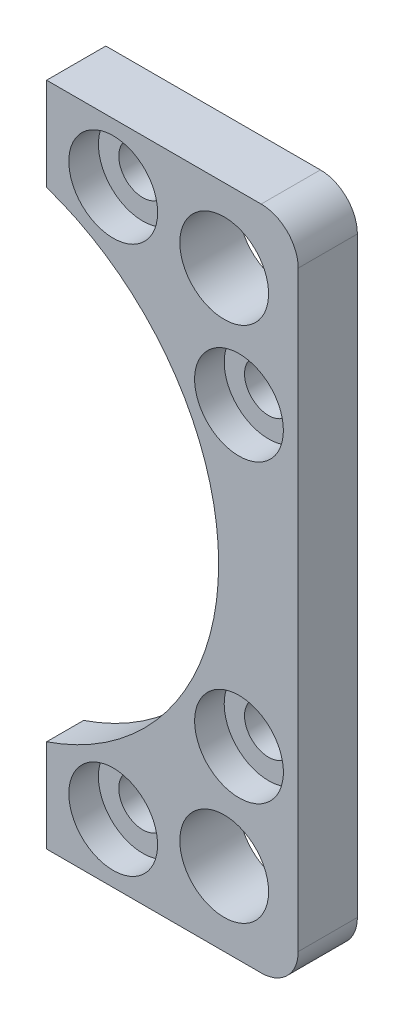
ISO-10303-21;
HEADER;
FILE_DESCRIPTION(('STEP AP214'),'2;1');
FILE_NAME('part.step','',(''),(''),'','','');
FILE_SCHEMA(('AUTOMOTIVE_DESIGN { 1 0 10303 214 1 1 1 1 }'));
ENDSEC;
DATA;
#1=APPLICATION_CONTEXT('core data for automotive mechanical design processes');
#2=APPLICATION_PROTOCOL_DEFINITION('international standard','automotive_design',2000,#1);
#3=PRODUCT_CONTEXT('',#1,'mechanical');
#4=PRODUCT('Part','Part','',(#3));
#5=PRODUCT_RELATED_PRODUCT_CATEGORY('part','',(#4));
#6=PRODUCT_DEFINITION_FORMATION('','',#4);
#7=PRODUCT_DEFINITION_CONTEXT('part definition',#1,'design');
#8=PRODUCT_DEFINITION('design','',#6,#7);
#9=PRODUCT_DEFINITION_SHAPE('','',#8);
#10=(LENGTH_UNIT() NAMED_UNIT(*) SI_UNIT(.MILLI.,.METRE.));
#11=(NAMED_UNIT(*) PLANE_ANGLE_UNIT() SI_UNIT($,.RADIAN.));
#12=(NAMED_UNIT(*) SI_UNIT($,.STERADIAN.) SOLID_ANGLE_UNIT());
#13=UNCERTAINTY_MEASURE_WITH_UNIT(LENGTH_MEASURE(1.E-05),#10,'distance_accuracy_value','');
#14=(GEOMETRIC_REPRESENTATION_CONTEXT(3) GLOBAL_UNCERTAINTY_ASSIGNED_CONTEXT((#13)) GLOBAL_UNIT_ASSIGNED_CONTEXT((#10,
#11,#12)) REPRESENTATION_CONTEXT('',''));
#15=CARTESIAN_POINT('',(0.,0.,0.));
#16=DIRECTION('',(0.,0.,1.));
#17=DIRECTION('',(1.,0.,0.));
#18=AXIS2_PLACEMENT_3D('',#15,#16,#17);
#19=CARTESIAN_POINT('',(19.9999999999998,36.9999999999999,4.));
#20=DIRECTION('',(0.,0.,-1.));
#21=DIRECTION('',(-1.,0.,0.));
#22=AXIS2_PLACEMENT_3D('',#19,#20,#21);
#23=CYLINDRICAL_SURFACE('',#22,3.25000000000001);
#24=CARTESIAN_POINT('',(19.9999999999998,36.9999999999999,-4.));
#25=DIRECTION('',(0.,0.,1.));
#26=DIRECTION('',(-1.,0.,0.));
#27=AXIS2_PLACEMENT_3D('',#24,#25,#26);
#28=CIRCLE('',#27,3.25000000000001);
#29=CARTESIAN_POINT('',(16.7499999999998,36.9999999999999,-4.));
#30=VERTEX_POINT('',#29);
#31=EDGE_CURVE('E163',#30,#30,#28,.T.);
#32=ORIENTED_EDGE('',*,*,#31,.F.);
#33=EDGE_LOOP('',(#32));
#34=FACE_BOUND('',#33,.T.);
#35=CARTESIAN_POINT('',(19.9999999999998,36.9999999999999,0.));
#36=DIRECTION('',(0.,0.,1.));
#37=DIRECTION('',(1.,0.,0.));
#38=AXIS2_PLACEMENT_3D('',#35,#36,#37);
#39=CIRCLE('',#38,3.25000000000001);
#40=CARTESIAN_POINT('',(23.2499999999998,36.9999999999999,0.));
#41=VERTEX_POINT('',#40);
#42=EDGE_CURVE('E52',#41,#41,#39,.T.);
#43=ORIENTED_EDGE('',*,*,#42,.T.);
#44=EDGE_LOOP('',(#43));
#45=FACE_BOUND('',#44,.T.);
#46=ADVANCED_FACE('F48',(#34,#45),#23,.F.);
#47=CARTESIAN_POINT('',(36.9999999999999,20.0000000000005,4.));
#48=DIRECTION('',(0.,0.,-1.));
#49=DIRECTION('',(-1.,0.,0.));
#50=AXIS2_PLACEMENT_3D('',#47,#48,#49);
#51=CYLINDRICAL_SURFACE('',#50,3.25000000000001);
#52=CARTESIAN_POINT('',(36.9999999999999,20.0000000000005,-4.));
#53=DIRECTION('',(0.,0.,1.));
#54=DIRECTION('',(-1.,0.,0.));
#55=AXIS2_PLACEMENT_3D('',#52,#53,#54);
#56=CIRCLE('',#55,3.25000000000001);
#57=CARTESIAN_POINT('',(33.7499999999999,20.0000000000005,-4.));
#58=VERTEX_POINT('',#57);
#59=EDGE_CURVE('E259',#58,#58,#56,.T.);
#60=ORIENTED_EDGE('',*,*,#59,.F.);
#61=EDGE_LOOP('',(#60));
#62=FACE_BOUND('',#61,.T.);
#63=CARTESIAN_POINT('',(36.9999999999999,20.0000000000005,0.));
#64=DIRECTION('',(0.,0.,1.));
#65=DIRECTION('',(1.,0.,0.));
#66=AXIS2_PLACEMENT_3D('',#63,#64,#65);
#67=CIRCLE('',#66,3.25000000000001);
#68=CARTESIAN_POINT('',(40.2499999999999,20.0000000000005,0.));
#69=VERTEX_POINT('',#68);
#70=EDGE_CURVE('E205',#69,#69,#67,.T.);
#71=ORIENTED_EDGE('',*,*,#70,.T.);
#72=EDGE_LOOP('',(#71));
#73=FACE_BOUND('',#72,.T.);
#74=ADVANCED_FACE('F307',(#62,#73),#51,.F.);
#75=CARTESIAN_POINT('',(0.,0.,4.));
#76=DIRECTION('',(0.,0.,-1.));
#77=DIRECTION('',(-1.,0.,0.));
#78=AXIS2_PLACEMENT_3D('',#75,#76,#77);
#79=CYLINDRICAL_SURFACE('',#78,34.25);
#80=CARTESIAN_POINT('',(0.,0.,-1.));
#81=DIRECTION('',(0.,0.,-1.));
#82=DIRECTION('',(-1.,0.,0.));
#83=AXIS2_PLACEMENT_3D('',#80,#81,#82);
#84=CIRCLE('',#83,34.25);
#85=CARTESIAN_POINT('',(11.,-32.4355129449189,-1.));
#86=VERTEX_POINT('',#85);
#87=CARTESIAN_POINT('',(11.,32.4355129449189,-1.));
#88=VERTEX_POINT('',#87);
#89=EDGE_CURVE('E244',#86,#88,#84,.F.);
#90=ORIENTED_EDGE('',*,*,#89,.F.);
#91=DIRECTION('',(0.,0.,-1.));
#92=VECTOR('',#91,1.);
#93=CARTESIAN_POINT('',(11.,-32.4355129449189,4.));
#94=LINE('',#93,#92);
#95=CARTESIAN_POINT('',(11.,-32.4355129449189,4.));
#96=VERTEX_POINT('',#95);
#97=EDGE_CURVE('E175',#96,#86,#94,.T.);
#98=ORIENTED_EDGE('',*,*,#97,.F.);
#99=CARTESIAN_POINT('',(0.,0.,4.));
#100=DIRECTION('',(0.,0.,-1.));
#101=DIRECTION('',(-1.,0.,0.));
#102=AXIS2_PLACEMENT_3D('',#99,#100,#101);
#103=CIRCLE('',#102,34.25);
#104=CARTESIAN_POINT('',(11.,32.4355129449189,4.));
#105=VERTEX_POINT('',#104);
#106=EDGE_CURVE('E273',#105,#96,#103,.T.);
#107=ORIENTED_EDGE('',*,*,#106,.F.);
#108=DIRECTION('',(0.,0.,-1.));
#109=VECTOR('',#108,1.);
#110=CARTESIAN_POINT('',(11.,32.4355129449189,4.));
#111=LINE('',#110,#109);
#112=EDGE_CURVE('E179',#105,#88,#111,.T.);
#113=ORIENTED_EDGE('',*,*,#112,.T.);
#114=EDGE_LOOP('',(#90,#98,#107,#113));
#115=FACE_BOUND('',#114,.T.);
#116=ADVANCED_FACE('F303',(#115),#79,.F.);
#117=CARTESIAN_POINT('',(0.,0.,4.));
#118=DIRECTION('',(0.,0.,-1.));
#119=DIRECTION('',(-1.,0.,0.));
#120=AXIS2_PLACEMENT_3D('',#117,#118,#119);
#121=PLANE('',#120);
#122=CARTESIAN_POINT('',(19.9999999999998,36.9999999999999,4.));
#123=DIRECTION('',(0.,0.,1.));
#124=DIRECTION('',(1.,0.,0.));
#125=AXIS2_PLACEMENT_3D('',#122,#123,#124);
#126=CIRCLE('',#125,6.);
#127=CARTESIAN_POINT('',(25.9999999999998,36.9999999999999,4.));
#128=VERTEX_POINT('',#127);
#129=EDGE_CURVE('E221',#128,#128,#126,.T.);
#130=ORIENTED_EDGE('',*,*,#129,.F.);
#131=EDGE_LOOP('',(#130));
#132=FACE_BOUND('',#131,.T.);
#133=CARTESIAN_POINT('',(36.9999999999999,-20.0000000000005,4.));
#134=DIRECTION('',(0.,0.,1.));
#135=DIRECTION('',(-1.,0.,0.));
#136=AXIS2_PLACEMENT_3D('',#133,#134,#135);
#137=CIRCLE('',#136,6.);
#138=CARTESIAN_POINT('',(30.9999999999999,-20.0000000000005,4.));
#139=VERTEX_POINT('',#138);
#140=EDGE_CURVE('E231',#139,#139,#137,.T.);
#141=ORIENTED_EDGE('',*,*,#140,.F.);
#142=EDGE_LOOP('',(#141));
#143=FACE_BOUND('',#142,.T.);
#144=CARTESIAN_POINT('',(19.9999999999998,-36.9999999999999,4.));
#145=DIRECTION('',(0.,0.,1.));
#146=DIRECTION('',(-1.,0.,0.));
#147=AXIS2_PLACEMENT_3D('',#144,#145,#146);
#148=CIRCLE('',#147,6.);
#149=CARTESIAN_POINT('',(13.9999999999998,-36.9999999999999,4.));
#150=VERTEX_POINT('',#149);
#151=EDGE_CURVE('E230',#150,#150,#148,.T.);
#152=ORIENTED_EDGE('',*,*,#151,.F.);
#153=EDGE_LOOP('',(#152));
#154=FACE_BOUND('',#153,.T.);
#155=CARTESIAN_POINT('',(36.9999999999999,20.0000000000005,4.));
#156=DIRECTION('',(0.,0.,1.));
#157=DIRECTION('',(1.,0.,0.));
#158=AXIS2_PLACEMENT_3D('',#155,#156,#157);
#159=CIRCLE('',#158,6.);
#160=CARTESIAN_POINT('',(42.9999999999999,20.0000000000005,4.));
#161=VERTEX_POINT('',#160);
#162=EDGE_CURVE('E236',#161,#161,#159,.T.);
#163=ORIENTED_EDGE('',*,*,#162,.F.);
#164=EDGE_LOOP('',(#163));
#165=FACE_BOUND('',#164,.T.);
#166=DIRECTION('',(1.,0.,0.));
#167=VECTOR('',#166,1.);
#168=CARTESIAN_POINT('',(45.,-45.,4.));
#169=LINE('',#168,#167);
#170=CARTESIAN_POINT('',(11.0000000000003,-45.,4.));
#171=VERTEX_POINT('',#170);
#172=CARTESIAN_POINT('',(40.,-45.,4.));
#173=VERTEX_POINT('',#172);
#174=EDGE_CURVE('E277',#171,#173,#169,.T.);
#175=ORIENTED_EDGE('',*,*,#174,.T.);
#176=CARTESIAN_POINT('',(40.,-40.,4.));
#177=DIRECTION('',(0.,0.,-1.));
#178=DIRECTION('',(-1.,0.,0.));
#179=AXIS2_PLACEMENT_3D('',#176,#177,#178);
#180=CIRCLE('',#179,5.);
#181=CARTESIAN_POINT('',(45.,-40.,4.));
#182=VERTEX_POINT('',#181);
#183=EDGE_CURVE('E57',#173,#182,#180,.F.);
#184=ORIENTED_EDGE('',*,*,#183,.T.);
#185=DIRECTION('',(0.,1.,0.));
#186=VECTOR('',#185,1.);
#187=CARTESIAN_POINT('',(45.,45.,4.));
#188=LINE('',#187,#186);
#189=CARTESIAN_POINT('',(45.,40.,4.));
#190=VERTEX_POINT('',#189);
#191=EDGE_CURVE('E176',#182,#190,#188,.T.);
#192=ORIENTED_EDGE('',*,*,#191,.T.);
#193=CARTESIAN_POINT('',(40.,40.,4.));
#194=DIRECTION('',(0.,0.,-1.));
#195=DIRECTION('',(-1.,0.,0.));
#196=AXIS2_PLACEMENT_3D('',#193,#194,#195);
#197=CIRCLE('',#196,5.);
#198=CARTESIAN_POINT('',(40.,45.,4.));
#199=VERTEX_POINT('',#198);
#200=EDGE_CURVE('E65',#190,#199,#197,.F.);
#201=ORIENTED_EDGE('',*,*,#200,.T.);
#202=DIRECTION('',(-1.,0.,0.));
#203=VECTOR('',#202,1.);
#204=CARTESIAN_POINT('',(10.9999999999997,45.,4.));
#205=LINE('',#204,#203);
#206=CARTESIAN_POINT('',(10.9999999999997,45.,4.));
#207=VERTEX_POINT('',#206);
#208=EDGE_CURVE('E171',#199,#207,#205,.T.);
#209=ORIENTED_EDGE('',*,*,#208,.T.);
#210=DIRECTION('',(0.,-1.,0.));
#211=VECTOR('',#210,1.);
#212=CARTESIAN_POINT('',(10.9999999999997,45.,4.));
#213=LINE('',#212,#211);
#214=EDGE_CURVE('E271',#207,#105,#213,.T.);
#215=ORIENTED_EDGE('',*,*,#214,.T.);
#216=ORIENTED_EDGE('',*,*,#106,.T.);
#217=DIRECTION('',(0.,-1.,0.));
#218=VECTOR('',#217,1.);
#219=CARTESIAN_POINT('',(11.0000000000003,-45.,4.));
#220=LINE('',#219,#218);
#221=EDGE_CURVE('E275',#96,#171,#220,.T.);
#222=ORIENTED_EDGE('',*,*,#221,.T.);
#223=EDGE_LOOP('',(#175,#184,#192,#201,#209,#215,#216,#222));
#224=FACE_BOUND('',#223,.T.);
#225=CARTESIAN_POINT('',(34.9999999999998,35.0000000000004,4.));
#226=DIRECTION('',(0.,0.,1.));
#227=DIRECTION('',(-1.,0.,0.));
#228=AXIS2_PLACEMENT_3D('',#225,#226,#227);
#229=CIRCLE('',#228,5.99999999999999);
#230=CARTESIAN_POINT('',(28.9999999999998,35.0000000000004,4.));
#231=VERTEX_POINT('',#230);
#232=EDGE_CURVE('E263',#231,#231,#229,.T.);
#233=ORIENTED_EDGE('',*,*,#232,.F.);
#234=EDGE_LOOP('',(#233));
#235=FACE_BOUND('',#234,.T.);
#236=CARTESIAN_POINT('',(35.0000000000002,-34.9999999999998,4.));
#237=DIRECTION('',(0.,0.,1.));
#238=DIRECTION('',(1.,0.,0.));
#239=AXIS2_PLACEMENT_3D('',#236,#237,#238);
#240=CIRCLE('',#239,5.99999999999999);
#241=CARTESIAN_POINT('',(41.0000000000002,-34.9999999999998,4.));
#242=VERTEX_POINT('',#241);
#243=EDGE_CURVE('E251',#242,#242,#240,.T.);
#244=ORIENTED_EDGE('',*,*,#243,.F.);
#245=EDGE_LOOP('',(#244));
#246=FACE_BOUND('',#245,.T.);
#247=ADVANCED_FACE('F279',(#132,#143,#154,#165,#224,#235,#246),#121,.F.);
#248=CARTESIAN_POINT('',(0.,0.,-4.));
#249=DIRECTION('',(0.,0.,-1.));
#250=DIRECTION('',(-1.,0.,0.));
#251=AXIS2_PLACEMENT_3D('',#248,#249,#250);
#252=PLANE('',#251);
#253=DIRECTION('',(0.,1.,0.));
#254=VECTOR('',#253,1.);
#255=CARTESIAN_POINT('',(45.,45.,-4.));
#256=LINE('',#255,#254);
#257=CARTESIAN_POINT('',(45.,-40.,-4.));
#258=VERTEX_POINT('',#257);
#259=CARTESIAN_POINT('',(45.,40.,-4.));
#260=VERTEX_POINT('',#259);
#261=EDGE_CURVE('E168',#258,#260,#256,.T.);
#262=ORIENTED_EDGE('',*,*,#261,.F.);
#263=CARTESIAN_POINT('',(40.,-40.,-4.));
#264=DIRECTION('',(0.,0.,-1.));
#265=DIRECTION('',(-1.,0.,0.));
#266=AXIS2_PLACEMENT_3D('',#263,#264,#265);
#267=CIRCLE('',#266,5.);
#268=CARTESIAN_POINT('',(40.,-45.,-4.));
#269=VERTEX_POINT('',#268);
#270=EDGE_CURVE('E194',#258,#269,#267,.T.);
#271=ORIENTED_EDGE('',*,*,#270,.T.);
#272=DIRECTION('',(1.,0.,0.));
#273=VECTOR('',#272,1.);
#274=CARTESIAN_POINT('',(45.,-45.,-4.));
#275=LINE('',#274,#273);
#276=CARTESIAN_POINT('',(11.0000000000003,-45.,-4.));
#277=VERTEX_POINT('',#276);
#278=EDGE_CURVE('E161',#277,#269,#275,.T.);
#279=ORIENTED_EDGE('',*,*,#278,.F.);
#280=DIRECTION('',(0.,-1.,0.));
#281=VECTOR('',#280,1.);
#282=CARTESIAN_POINT('',(11.0000000000003,-45.,-4.));
#283=LINE('',#282,#281);
#284=CARTESIAN_POINT('',(11.,-34.2782730020052,-4.));
#285=VERTEX_POINT('',#284);
#286=EDGE_CURVE('E153',#285,#277,#283,.T.);
#287=ORIENTED_EDGE('',*,*,#286,.F.);
#288=CARTESIAN_POINT('',(0.,0.,-4.));
#289=DIRECTION('',(0.,0.,-1.));
#290=DIRECTION('',(-1.,0.,0.));
#291=AXIS2_PLACEMENT_3D('',#288,#289,#290);
#292=CIRCLE('',#291,36.);
#293=CARTESIAN_POINT('',(10.9999999999999,34.2782730020052,-4.));
#294=VERTEX_POINT('',#293);
#295=EDGE_CURVE('E134',#294,#285,#292,.T.);
#296=ORIENTED_EDGE('',*,*,#295,.F.);
#297=DIRECTION('',(0.,-1.,0.));
#298=VECTOR('',#297,1.);
#299=CARTESIAN_POINT('',(10.9999999999997,45.,-4.));
#300=LINE('',#299,#298);
#301=CARTESIAN_POINT('',(10.9999999999997,45.,-4.));
#302=VERTEX_POINT('',#301);
#303=EDGE_CURVE('E150',#302,#294,#300,.T.);
#304=ORIENTED_EDGE('',*,*,#303,.F.);
#305=DIRECTION('',(-1.,0.,0.));
#306=VECTOR('',#305,1.);
#307=CARTESIAN_POINT('',(10.9999999999997,45.,-4.));
#308=LINE('',#307,#306);
#309=CARTESIAN_POINT('',(40.,45.,-4.));
#310=VERTEX_POINT('',#309);
#311=EDGE_CURVE('E159',#310,#302,#308,.T.);
#312=ORIENTED_EDGE('',*,*,#311,.F.);
#313=CARTESIAN_POINT('',(40.,40.,-4.));
#314=DIRECTION('',(0.,0.,-1.));
#315=DIRECTION('',(-1.,0.,0.));
#316=AXIS2_PLACEMENT_3D('',#313,#314,#315);
#317=CIRCLE('',#316,5.);
#318=EDGE_CURVE('E192',#310,#260,#317,.T.);
#319=ORIENTED_EDGE('',*,*,#318,.T.);
#320=EDGE_LOOP('',(#262,#271,#279,#287,#296,#304,#312,#319));
#321=FACE_BOUND('',#320,.T.);
#322=CARTESIAN_POINT('',(35.0000000000002,-34.9999999999998,-4.));
#323=DIRECTION('',(0.,0.,1.));
#324=DIRECTION('',(1.,0.,0.));
#325=AXIS2_PLACEMENT_3D('',#322,#323,#324);
#326=CIRCLE('',#325,5.99999999999999);
#327=CARTESIAN_POINT('',(41.0000000000002,-34.9999999999998,-4.));
#328=VERTEX_POINT('',#327);
#329=EDGE_CURVE('E250',#328,#328,#326,.T.);
#330=ORIENTED_EDGE('',*,*,#329,.T.);
#331=EDGE_LOOP('',(#330));
#332=FACE_BOUND('',#331,.T.);
#333=ORIENTED_EDGE('',*,*,#59,.T.);
#334=EDGE_LOOP('',(#333));
#335=FACE_BOUND('',#334,.T.);
#336=ORIENTED_EDGE('',*,*,#31,.T.);
#337=EDGE_LOOP('',(#336));
#338=FACE_BOUND('',#337,.T.);
#339=CARTESIAN_POINT('',(34.9999999999998,35.0000000000004,-4.));
#340=DIRECTION('',(0.,0.,1.));
#341=DIRECTION('',(-1.,0.,0.));
#342=AXIS2_PLACEMENT_3D('',#339,#340,#341);
#343=CIRCLE('',#342,5.99999999999999);
#344=CARTESIAN_POINT('',(28.9999999999998,35.0000000000004,-4.));
#345=VERTEX_POINT('',#344);
#346=EDGE_CURVE('E262',#345,#345,#343,.T.);
#347=ORIENTED_EDGE('',*,*,#346,.T.);
#348=EDGE_LOOP('',(#347));
#349=FACE_BOUND('',#348,.T.);
#350=CARTESIAN_POINT('',(37.0000000000002,-19.9999999999998,-4.));
#351=DIRECTION('',(0.,0.,1.));
#352=DIRECTION('',(1.,0.,0.));
#353=AXIS2_PLACEMENT_3D('',#350,#351,#352);
#354=CIRCLE('',#353,3.25);
#355=CARTESIAN_POINT('',(40.2500000000002,-19.9999999999998,-4.));
#356=VERTEX_POINT('',#355);
#357=EDGE_CURVE('E254',#356,#356,#354,.T.);
#358=ORIENTED_EDGE('',*,*,#357,.T.);
#359=EDGE_LOOP('',(#358));
#360=FACE_BOUND('',#359,.T.);
#361=CARTESIAN_POINT('',(20.0000000000003,-36.9999999999997,-4.));
#362=DIRECTION('',(0.,0.,1.));
#363=DIRECTION('',(1.,0.,0.));
#364=AXIS2_PLACEMENT_3D('',#361,#362,#363);
#365=CIRCLE('',#364,3.24999999999999);
#366=CARTESIAN_POINT('',(23.2500000000003,-36.9999999999997,-4.));
#367=VERTEX_POINT('',#366);
#368=EDGE_CURVE('E140',#367,#367,#365,.T.);
#369=ORIENTED_EDGE('',*,*,#368,.T.);
#370=EDGE_LOOP('',(#369));
#371=FACE_BOUND('',#370,.T.);
#372=ADVANCED_FACE('F147',(#321,#332,#335,#338,#349,#360,#371),#252,.T.);
#373=CARTESIAN_POINT('',(10.9999999999997,45.,4.));
#374=DIRECTION('',(0.,-1.,0.));
#375=DIRECTION('',(0.,0.,-1.));
#376=AXIS2_PLACEMENT_3D('',#373,#374,#375);
#377=PLANE('',#376);
#378=ORIENTED_EDGE('',*,*,#208,.F.);
#379=DIRECTION('',(0.,0.,-1.));
#380=VECTOR('',#379,1.);
#381=CARTESIAN_POINT('',(40.,45.,4.));
#382=LINE('',#381,#380);
#383=EDGE_CURVE('E13',#199,#310,#382,.T.);
#384=ORIENTED_EDGE('',*,*,#383,.T.);
#385=ORIENTED_EDGE('',*,*,#311,.T.);
#386=DIRECTION('',(0.,0.,-1.));
#387=VECTOR('',#386,1.);
#388=CARTESIAN_POINT('',(10.9999999999997,45.,4.));
#389=LINE('',#388,#387);
#390=EDGE_CURVE('E158',#207,#302,#389,.T.);
#391=ORIENTED_EDGE('',*,*,#390,.F.);
#392=EDGE_LOOP('',(#378,#384,#385,#391));
#393=FACE_BOUND('',#392,.T.);
#394=ADVANCED_FACE('F288',(#393),#377,.F.);
#395=CARTESIAN_POINT('',(10.9999999999997,45.,4.));
#396=DIRECTION('',(1.,0.,0.));
#397=DIRECTION('',(0.,1.,0.));
#398=AXIS2_PLACEMENT_3D('',#395,#396,#397);
#399=PLANE('',#398);
#400=ORIENTED_EDGE('',*,*,#303,.T.);
#401=DIRECTION('',(0.,0.,-1.));
#402=VECTOR('',#401,1.);
#403=CARTESIAN_POINT('',(10.9999999999999,34.2782730020052,-1.));
#404=LINE('',#403,#402);
#405=CARTESIAN_POINT('',(10.9999999999999,34.2782730020052,-1.));
#406=VERTEX_POINT('',#405);
#407=EDGE_CURVE('E130',#294,#406,#404,.F.);
#408=ORIENTED_EDGE('',*,*,#407,.T.);
#409=DIRECTION('',(0.,1.,0.));
#410=VECTOR('',#409,1.);
#411=CARTESIAN_POINT('',(10.9999999999997,45.,-1.));
#412=LINE('',#411,#410);
#413=EDGE_CURVE('E141',#88,#406,#412,.T.);
#414=ORIENTED_EDGE('',*,*,#413,.F.);
#415=ORIENTED_EDGE('',*,*,#112,.F.);
#416=ORIENTED_EDGE('',*,*,#214,.F.);
#417=ORIENTED_EDGE('',*,*,#390,.T.);
#418=EDGE_LOOP('',(#400,#408,#414,#415,#416,#417));
#419=FACE_BOUND('',#418,.T.);
#420=ADVANCED_FACE('F155',(#419),#399,.F.);
#421=CARTESIAN_POINT('',(11.0000000000003,-45.,4.));
#422=DIRECTION('',(1.,0.,0.));
#423=DIRECTION('',(0.,1.,0.));
#424=AXIS2_PLACEMENT_3D('',#421,#422,#423);
#425=PLANE('',#424);
#426=DIRECTION('',(0.,1.,0.));
#427=VECTOR('',#426,1.);
#428=CARTESIAN_POINT('',(11.0000000000003,-45.,-1.));
#429=LINE('',#428,#427);
#430=CARTESIAN_POINT('',(11.,-34.2782730020052,-1.));
#431=VERTEX_POINT('',#430);
#432=EDGE_CURVE('E183',#431,#86,#429,.T.);
#433=ORIENTED_EDGE('',*,*,#432,.F.);
#434=DIRECTION('',(0.,0.,-1.));
#435=VECTOR('',#434,1.);
#436=CARTESIAN_POINT('',(11.,-34.2782730020052,-1.));
#437=LINE('',#436,#435);
#438=EDGE_CURVE('E185',#431,#285,#437,.T.);
#439=ORIENTED_EDGE('',*,*,#438,.T.);
#440=ORIENTED_EDGE('',*,*,#286,.T.);
#441=DIRECTION('',(0.,0.,-1.));
#442=VECTOR('',#441,1.);
#443=CARTESIAN_POINT('',(11.0000000000003,-45.,4.));
#444=LINE('',#443,#442);
#445=EDGE_CURVE('E172',#171,#277,#444,.T.);
#446=ORIENTED_EDGE('',*,*,#445,.F.);
#447=ORIENTED_EDGE('',*,*,#221,.F.);
#448=ORIENTED_EDGE('',*,*,#97,.T.);
#449=EDGE_LOOP('',(#433,#439,#440,#446,#447,#448));
#450=FACE_BOUND('',#449,.T.);
#451=ADVANCED_FACE('F297',(#450),#425,.F.);
#452=CARTESIAN_POINT('',(45.,-45.,4.));
#453=DIRECTION('',(0.,1.,0.));
#454=DIRECTION('',(0.,0.,1.));
#455=AXIS2_PLACEMENT_3D('',#452,#453,#454);
#456=PLANE('',#455);
#457=ORIENTED_EDGE('',*,*,#278,.T.);
#458=DIRECTION('',(0.,0.,-1.));
#459=VECTOR('',#458,1.);
#460=CARTESIAN_POINT('',(40.,-45.,4.));
#461=LINE('',#460,#459);
#462=EDGE_CURVE('E73',#269,#173,#461,.F.);
#463=ORIENTED_EDGE('',*,*,#462,.T.);
#464=ORIENTED_EDGE('',*,*,#174,.F.);
#465=ORIENTED_EDGE('',*,*,#445,.T.);
#466=EDGE_LOOP('',(#457,#463,#464,#465));
#467=FACE_BOUND('',#466,.T.);
#468=ADVANCED_FACE('F292',(#467),#456,.F.);
#469=CARTESIAN_POINT('',(45.,45.,4.));
#470=DIRECTION('',(-1.,0.,0.));
#471=DIRECTION('',(0.,0.,1.));
#472=AXIS2_PLACEMENT_3D('',#469,#470,#471);
#473=PLANE('',#472);
#474=ORIENTED_EDGE('',*,*,#191,.F.);
#475=DIRECTION('',(0.,0.,-1.));
#476=VECTOR('',#475,1.);
#477=CARTESIAN_POINT('',(45.,-40.,4.));
#478=LINE('',#477,#476);
#479=EDGE_CURVE('E189',#182,#258,#478,.T.);
#480=ORIENTED_EDGE('',*,*,#479,.T.);
#481=ORIENTED_EDGE('',*,*,#261,.T.);
#482=DIRECTION('',(0.,0.,-1.));
#483=VECTOR('',#482,1.);
#484=CARTESIAN_POINT('',(45.,40.,4.));
#485=LINE('',#484,#483);
#486=EDGE_CURVE('E187',#260,#190,#485,.F.);
#487=ORIENTED_EDGE('',*,*,#486,.T.);
#488=EDGE_LOOP('',(#474,#480,#481,#487));
#489=FACE_BOUND('',#488,.T.);
#490=ADVANCED_FACE('F289',(#489),#473,.F.);
#491=CARTESIAN_POINT('',(34.9999999999998,35.0000000000004,4.));
#492=DIRECTION('',(0.,0.,-1.));
#493=DIRECTION('',(-1.,0.,0.));
#494=AXIS2_PLACEMENT_3D('',#491,#492,#493);
#495=CYLINDRICAL_SURFACE('',#494,5.99999999999999);
#496=ORIENTED_EDGE('',*,*,#232,.T.);
#497=EDGE_LOOP('',(#496));
#498=FACE_BOUND('',#497,.T.);
#499=ORIENTED_EDGE('',*,*,#346,.F.);
#500=EDGE_LOOP('',(#499));
#501=FACE_BOUND('',#500,.T.);
#502=ADVANCED_FACE('F326',(#498,#501),#495,.F.);
#503=CARTESIAN_POINT('',(37.0000000000002,-19.9999999999998,4.));
#504=DIRECTION('',(0.,0.,-1.));
#505=DIRECTION('',(-1.,0.,0.));
#506=AXIS2_PLACEMENT_3D('',#503,#504,#505);
#507=CYLINDRICAL_SURFACE('',#506,3.25);
#508=CARTESIAN_POINT('',(37.0000000000002,-19.9999999999998,0.));
#509=DIRECTION('',(0.,0.,-1.));
#510=DIRECTION('',(-1.,0.,0.));
#511=AXIS2_PLACEMENT_3D('',#508,#509,#510);
#512=CIRCLE('',#511,3.25);
#513=CARTESIAN_POINT('',(33.7500000000002,-19.9999999999998,0.));
#514=VERTEX_POINT('',#513);
#515=EDGE_CURVE('E202',#514,#514,#512,.T.);
#516=ORIENTED_EDGE('',*,*,#515,.F.);
#517=EDGE_LOOP('',(#516));
#518=FACE_BOUND('',#517,.T.);
#519=ORIENTED_EDGE('',*,*,#357,.F.);
#520=EDGE_LOOP('',(#519));
#521=FACE_BOUND('',#520,.T.);
#522=ADVANCED_FACE('F362',(#518,#521),#507,.F.);
#523=CARTESIAN_POINT('',(35.0000000000002,-34.9999999999998,4.));
#524=DIRECTION('',(0.,0.,-1.));
#525=DIRECTION('',(-1.,0.,0.));
#526=AXIS2_PLACEMENT_3D('',#523,#524,#525);
#527=CYLINDRICAL_SURFACE('',#526,5.99999999999999);
#528=ORIENTED_EDGE('',*,*,#243,.T.);
#529=EDGE_LOOP('',(#528));
#530=FACE_BOUND('',#529,.T.);
#531=ORIENTED_EDGE('',*,*,#329,.F.);
#532=EDGE_LOOP('',(#531));
#533=FACE_BOUND('',#532,.T.);
#534=ADVANCED_FACE('F358',(#530,#533),#527,.F.);
#535=CARTESIAN_POINT('',(20.0000000000003,-36.9999999999997,4.));
#536=DIRECTION('',(0.,0.,-1.));
#537=DIRECTION('',(-1.,0.,0.));
#538=AXIS2_PLACEMENT_3D('',#535,#536,#537);
#539=CYLINDRICAL_SURFACE('',#538,3.24999999999999);
#540=CARTESIAN_POINT('',(20.0000000000003,-36.9999999999997,0.));
#541=DIRECTION('',(0.,0.,-1.));
#542=DIRECTION('',(-1.,0.,0.));
#543=AXIS2_PLACEMENT_3D('',#540,#541,#542);
#544=CIRCLE('',#543,3.24999999999999);
#545=CARTESIAN_POINT('',(16.7500000000003,-36.9999999999997,0.));
#546=VERTEX_POINT('',#545);
#547=EDGE_CURVE('E199',#546,#546,#544,.T.);
#548=ORIENTED_EDGE('',*,*,#547,.F.);
#549=EDGE_LOOP('',(#548));
#550=FACE_BOUND('',#549,.T.);
#551=ORIENTED_EDGE('',*,*,#368,.F.);
#552=EDGE_LOOP('',(#551));
#553=FACE_BOUND('',#552,.T.);
#554=ADVANCED_FACE('F351',(#550,#553),#539,.F.);
#555=CARTESIAN_POINT('',(0.,0.,-1.));
#556=DIRECTION('',(0.,0.,-1.));
#557=DIRECTION('',(-1.,0.,0.));
#558=AXIS2_PLACEMENT_3D('',#555,#556,#557);
#559=CYLINDRICAL_SURFACE('',#558,36.);
#560=ORIENTED_EDGE('',*,*,#295,.T.);
#561=ORIENTED_EDGE('',*,*,#438,.F.);
#562=CARTESIAN_POINT('',(0.,0.,-1.));
#563=DIRECTION('',(0.,0.,-1.));
#564=DIRECTION('',(-1.,0.,0.));
#565=AXIS2_PLACEMENT_3D('',#562,#563,#564);
#566=CIRCLE('',#565,36.);
#567=EDGE_CURVE('E136',#406,#431,#566,.T.);
#568=ORIENTED_EDGE('',*,*,#567,.F.);
#569=ORIENTED_EDGE('',*,*,#407,.F.);
#570=EDGE_LOOP('',(#560,#561,#568,#569));
#571=FACE_BOUND('',#570,.T.);
#572=ADVANCED_FACE('F132',(#571),#559,.F.);
#573=CARTESIAN_POINT('',(0.,0.,-1.));
#574=DIRECTION('',(0.,0.,-1.));
#575=DIRECTION('',(-1.,0.,0.));
#576=AXIS2_PLACEMENT_3D('',#573,#574,#575);
#577=PLANE('',#576);
#578=ORIENTED_EDGE('',*,*,#413,.T.);
#579=ORIENTED_EDGE('',*,*,#567,.T.);
#580=ORIENTED_EDGE('',*,*,#432,.T.);
#581=ORIENTED_EDGE('',*,*,#89,.T.);
#582=EDGE_LOOP('',(#578,#579,#580,#581));
#583=FACE_BOUND('',#582,.T.);
#584=ADVANCED_FACE('F301',(#583),#577,.T.);
#585=CARTESIAN_POINT('',(40.,-40.,4.));
#586=DIRECTION('',(0.,0.,-1.));
#587=DIRECTION('',(-1.,0.,0.));
#588=AXIS2_PLACEMENT_3D('',#585,#586,#587);
#589=CYLINDRICAL_SURFACE('',#588,5.);
#590=ORIENTED_EDGE('',*,*,#183,.F.);
#591=ORIENTED_EDGE('',*,*,#462,.F.);
#592=ORIENTED_EDGE('',*,*,#270,.F.);
#593=ORIENTED_EDGE('',*,*,#479,.F.);
#594=EDGE_LOOP('',(#590,#591,#592,#593));
#595=FACE_BOUND('',#594,.T.);
#596=ADVANCED_FACE('F291',(#595),#589,.T.);
#597=CARTESIAN_POINT('',(40.,40.,4.));
#598=DIRECTION('',(0.,0.,-1.));
#599=DIRECTION('',(-1.,0.,0.));
#600=AXIS2_PLACEMENT_3D('',#597,#598,#599);
#601=CYLINDRICAL_SURFACE('',#600,5.);
#602=ORIENTED_EDGE('',*,*,#200,.F.);
#603=ORIENTED_EDGE('',*,*,#486,.F.);
#604=ORIENTED_EDGE('',*,*,#318,.F.);
#605=ORIENTED_EDGE('',*,*,#383,.F.);
#606=EDGE_LOOP('',(#602,#603,#604,#605));
#607=FACE_BOUND('',#606,.T.);
#608=ADVANCED_FACE('F50',(#607),#601,.T.);
#609=CARTESIAN_POINT('',(19.9999999999998,-36.9999999999999,0.));
#610=DIRECTION('',(0.,0.,1.));
#611=DIRECTION('',(1.,0.,0.));
#612=AXIS2_PLACEMENT_3D('',#609,#610,#611);
#613=CYLINDRICAL_SURFACE('',#612,6.);
#614=CARTESIAN_POINT('',(19.9999999999998,-36.9999999999999,0.));
#615=DIRECTION('',(0.,0.,1.));
#616=DIRECTION('',(-1.,0.,0.));
#617=AXIS2_PLACEMENT_3D('',#614,#615,#616);
#618=CIRCLE('',#617,6.);
#619=CARTESIAN_POINT('',(13.9999999999998,-36.9999999999999,0.));
#620=VERTEX_POINT('',#619);
#621=EDGE_CURVE('E239',#620,#620,#618,.T.);
#622=ORIENTED_EDGE('',*,*,#621,.F.);
#623=EDGE_LOOP('',(#622));
#624=FACE_BOUND('',#623,.T.);
#625=ORIENTED_EDGE('',*,*,#151,.T.);
#626=EDGE_LOOP('',(#625));
#627=FACE_BOUND('',#626,.T.);
#628=ADVANCED_FACE('F346',(#624,#627),#613,.F.);
#629=CARTESIAN_POINT('',(19.9999999999998,-36.9999999999999,0.));
#630=DIRECTION('',(0.,0.,-1.));
#631=DIRECTION('',(-1.,0.,0.));
#632=AXIS2_PLACEMENT_3D('',#629,#630,#631);
#633=PLANE('',#632);
#634=ORIENTED_EDGE('',*,*,#547,.T.);
#635=EDGE_LOOP('',(#634));
#636=FACE_BOUND('',#635,.T.);
#637=ORIENTED_EDGE('',*,*,#621,.T.);
#638=EDGE_LOOP('',(#637));
#639=FACE_BOUND('',#638,.T.);
#640=ADVANCED_FACE('F388',(#636,#639),#633,.F.);
#641=CARTESIAN_POINT('',(36.9999999999999,-20.0000000000005,0.));
#642=DIRECTION('',(0.,0.,1.));
#643=DIRECTION('',(1.,0.,0.));
#644=AXIS2_PLACEMENT_3D('',#641,#642,#643);
#645=CYLINDRICAL_SURFACE('',#644,6.);
#646=CARTESIAN_POINT('',(36.9999999999999,-20.0000000000005,0.));
#647=DIRECTION('',(0.,0.,1.));
#648=DIRECTION('',(-1.,0.,0.));
#649=AXIS2_PLACEMENT_3D('',#646,#647,#648);
#650=CIRCLE('',#649,6.);
#651=CARTESIAN_POINT('',(30.9999999999999,-20.0000000000005,0.));
#652=VERTEX_POINT('',#651);
#653=EDGE_CURVE('E227',#652,#652,#650,.T.);
#654=ORIENTED_EDGE('',*,*,#653,.F.);
#655=EDGE_LOOP('',(#654));
#656=FACE_BOUND('',#655,.T.);
#657=ORIENTED_EDGE('',*,*,#140,.T.);
#658=EDGE_LOOP('',(#657));
#659=FACE_BOUND('',#658,.T.);
#660=ADVANCED_FACE('F382',(#656,#659),#645,.F.);
#661=CARTESIAN_POINT('',(36.9999999999999,-20.0000000000005,0.));
#662=DIRECTION('',(0.,0.,-1.));
#663=DIRECTION('',(-1.,0.,0.));
#664=AXIS2_PLACEMENT_3D('',#661,#662,#663);
#665=PLANE('',#664);
#666=ORIENTED_EDGE('',*,*,#515,.T.);
#667=EDGE_LOOP('',(#666));
#668=FACE_BOUND('',#667,.T.);
#669=ORIENTED_EDGE('',*,*,#653,.T.);
#670=EDGE_LOOP('',(#669));
#671=FACE_BOUND('',#670,.T.);
#672=ADVANCED_FACE('F378',(#668,#671),#665,.F.);
#673=CARTESIAN_POINT('',(36.9999999999999,20.0000000000005,0.));
#674=DIRECTION('',(0.,0.,1.));
#675=DIRECTION('',(1.,0.,0.));
#676=AXIS2_PLACEMENT_3D('',#673,#674,#675);
#677=CYLINDRICAL_SURFACE('',#676,6.);
#678=CARTESIAN_POINT('',(36.9999999999999,20.0000000000005,0.));
#679=DIRECTION('',(0.,0.,1.));
#680=DIRECTION('',(1.,0.,0.));
#681=AXIS2_PLACEMENT_3D('',#678,#679,#680);
#682=CIRCLE('',#681,6.);
#683=CARTESIAN_POINT('',(42.9999999999999,20.0000000000005,0.));
#684=VERTEX_POINT('',#683);
#685=EDGE_CURVE('E224',#684,#684,#682,.T.);
#686=ORIENTED_EDGE('',*,*,#685,.F.);
#687=EDGE_LOOP('',(#686));
#688=FACE_BOUND('',#687,.T.);
#689=ORIENTED_EDGE('',*,*,#162,.T.);
#690=EDGE_LOOP('',(#689));
#691=FACE_BOUND('',#690,.T.);
#692=ADVANCED_FACE('F381',(#688,#691),#677,.F.);
#693=CARTESIAN_POINT('',(36.9999999999999,20.0000000000005,0.));
#694=DIRECTION('',(0.,0.,1.));
#695=DIRECTION('',(1.,0.,0.));
#696=AXIS2_PLACEMENT_3D('',#693,#694,#695);
#697=PLANE('',#696);
#698=ORIENTED_EDGE('',*,*,#70,.F.);
#699=EDGE_LOOP('',(#698));
#700=FACE_BOUND('',#699,.T.);
#701=ORIENTED_EDGE('',*,*,#685,.T.);
#702=EDGE_LOOP('',(#701));
#703=FACE_BOUND('',#702,.T.);
#704=ADVANCED_FACE('F398',(#700,#703),#697,.T.);
#705=CARTESIAN_POINT('',(19.9999999999998,36.9999999999999,0.));
#706=DIRECTION('',(0.,0.,1.));
#707=DIRECTION('',(1.,0.,0.));
#708=AXIS2_PLACEMENT_3D('',#705,#706,#707);
#709=CYLINDRICAL_SURFACE('',#708,6.);
#710=CARTESIAN_POINT('',(19.9999999999998,36.9999999999999,0.));
#711=DIRECTION('',(0.,0.,1.));
#712=DIRECTION('',(1.,0.,0.));
#713=AXIS2_PLACEMENT_3D('',#710,#711,#712);
#714=CIRCLE('',#713,6.);
#715=CARTESIAN_POINT('',(25.9999999999998,36.9999999999999,0.));
#716=VERTEX_POINT('',#715);
#717=EDGE_CURVE('E203',#716,#716,#714,.T.);
#718=ORIENTED_EDGE('',*,*,#717,.F.);
#719=EDGE_LOOP('',(#718));
#720=FACE_BOUND('',#719,.T.);
#721=ORIENTED_EDGE('',*,*,#129,.T.);
#722=EDGE_LOOP('',(#721));
#723=FACE_BOUND('',#722,.T.);
#724=ADVANCED_FACE('F216',(#720,#723),#709,.F.);
#725=CARTESIAN_POINT('',(19.9999999999998,36.9999999999999,0.));
#726=DIRECTION('',(0.,0.,1.));
#727=DIRECTION('',(1.,0.,0.));
#728=AXIS2_PLACEMENT_3D('',#725,#726,#727);
#729=PLANE('',#728);
#730=ORIENTED_EDGE('',*,*,#42,.F.);
#731=EDGE_LOOP('',(#730));
#732=FACE_BOUND('',#731,.T.);
#733=ORIENTED_EDGE('',*,*,#717,.T.);
#734=EDGE_LOOP('',(#733));
#735=FACE_BOUND('',#734,.T.);
#736=ADVANCED_FACE('F213',(#732,#735),#729,.T.);
#737=CLOSED_SHELL('',(#46,#74,#116,#247,#372,#394,#420,#451,#468,#490,#502,#522,#534,#554,#572,
#584,#596,#608,#628,#640,#660,#672,#692,#704,#724,#736));
#738=MANIFOLD_SOLID_BREP('B2',#737);
#739=ADVANCED_BREP_SHAPE_REPRESENTATION('',(#18,#738),#14);
#740=SHAPE_DEFINITION_REPRESENTATION(#9,#739);
ENDSEC;
END-ISO-10303-21;
